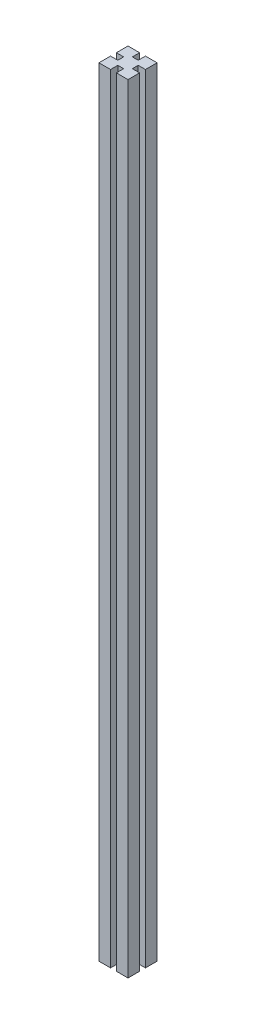
ISO-10303-21;
HEADER;
FILE_DESCRIPTION(('STEP AP214'),'2;1');
FILE_NAME('part.step','',(''),(''),'','','');
FILE_SCHEMA(('AUTOMOTIVE_DESIGN { 1 0 10303 214 1 1 1 1 }'));
ENDSEC;
DATA;
#1=APPLICATION_CONTEXT('core data for automotive mechanical design processes');
#2=APPLICATION_PROTOCOL_DEFINITION('international standard','automotive_design',2000,#1);
#3=PRODUCT_CONTEXT('',#1,'mechanical');
#4=PRODUCT('Part','Part','',(#3));
#5=PRODUCT_RELATED_PRODUCT_CATEGORY('part','',(#4));
#6=PRODUCT_DEFINITION_FORMATION('','',#4);
#7=PRODUCT_DEFINITION_CONTEXT('part definition',#1,'design');
#8=PRODUCT_DEFINITION('design','',#6,#7);
#9=PRODUCT_DEFINITION_SHAPE('','',#8);
#10=(LENGTH_UNIT() NAMED_UNIT(*) SI_UNIT(.MILLI.,.METRE.));
#11=(NAMED_UNIT(*) PLANE_ANGLE_UNIT() SI_UNIT($,.RADIAN.));
#12=(NAMED_UNIT(*) SI_UNIT($,.STERADIAN.) SOLID_ANGLE_UNIT());
#13=UNCERTAINTY_MEASURE_WITH_UNIT(LENGTH_MEASURE(1.E-05),#10,'distance_accuracy_value','');
#14=(GEOMETRIC_REPRESENTATION_CONTEXT(3) GLOBAL_UNCERTAINTY_ASSIGNED_CONTEXT((#13)) GLOBAL_UNIT_ASSIGNED_CONTEXT((#10,
#11,#12)) REPRESENTATION_CONTEXT('',''));
#15=CARTESIAN_POINT('',(0.,0.,0.));
#16=DIRECTION('',(0.,0.,1.));
#17=DIRECTION('',(1.,0.,0.));
#18=AXIS2_PLACEMENT_3D('',#15,#16,#17);
#19=CARTESIAN_POINT('',(5.00000000000001,1338.,25.));
#20=DIRECTION('',(0.,0.,-1.));
#21=DIRECTION('',(-1.,0.,0.));
#22=AXIS2_PLACEMENT_3D('',#19,#20,#21);
#23=PLANE('',#22);
#24=DIRECTION('',(1.,0.,0.));
#25=VECTOR('',#24,1.);
#26=CARTESIAN_POINT('',(5.00000000000001,0.,25.));
#27=LINE('',#26,#25);
#28=CARTESIAN_POINT('',(5.00000000000001,0.,25.));
#29=VERTEX_POINT('',#28);
#30=CARTESIAN_POINT('',(25.,0.,25.));
#31=VERTEX_POINT('',#30);
#32=EDGE_CURVE('E198',#29,#31,#27,.T.);
#33=ORIENTED_EDGE('',*,*,#32,.T.);
#34=DIRECTION('',(0.,-1.,0.));
#35=VECTOR('',#34,1.);
#36=CARTESIAN_POINT('',(25.,1338.,25.));
#37=LINE('',#36,#35);
#38=CARTESIAN_POINT('',(25.,1338.,25.));
#39=VERTEX_POINT('',#38);
#40=EDGE_CURVE('E11',#39,#31,#37,.T.);
#41=ORIENTED_EDGE('',*,*,#40,.F.);
#42=DIRECTION('',(1.,0.,0.));
#43=VECTOR('',#42,1.);
#44=CARTESIAN_POINT('',(5.00000000000001,1338.,25.));
#45=LINE('',#44,#43);
#46=CARTESIAN_POINT('',(5.00000000000001,1338.,25.));
#47=VERTEX_POINT('',#46);
#48=EDGE_CURVE('E253',#47,#39,#45,.T.);
#49=ORIENTED_EDGE('',*,*,#48,.F.);
#50=DIRECTION('',(0.,-1.,0.));
#51=VECTOR('',#50,1.);
#52=CARTESIAN_POINT('',(5.00000000000001,1338.,25.));
#53=LINE('',#52,#51);
#54=EDGE_CURVE('E118',#47,#29,#53,.T.);
#55=ORIENTED_EDGE('',*,*,#54,.T.);
#56=EDGE_LOOP('',(#33,#41,#49,#55));
#57=FACE_BOUND('',#56,.T.);
#58=ADVANCED_FACE('F32',(#57),#23,.F.);
#59=CARTESIAN_POINT('',(25.,1338.,5.));
#60=DIRECTION('',(-1.,0.,0.));
#61=DIRECTION('',(0.,0.,1.));
#62=AXIS2_PLACEMENT_3D('',#59,#60,#61);
#63=PLANE('',#62);
#64=DIRECTION('',(0.,0.,-1.));
#65=VECTOR('',#64,1.);
#66=CARTESIAN_POINT('',(25.,0.,5.));
#67=LINE('',#66,#65);
#68=CARTESIAN_POINT('',(25.,0.,5.));
#69=VERTEX_POINT('',#68);
#70=EDGE_CURVE('E200',#31,#69,#67,.T.);
#71=ORIENTED_EDGE('',*,*,#70,.T.);
#72=DIRECTION('',(0.,-1.,0.));
#73=VECTOR('',#72,1.);
#74=CARTESIAN_POINT('',(25.,1338.,5.));
#75=LINE('',#74,#73);
#76=CARTESIAN_POINT('',(25.,1338.,5.));
#77=VERTEX_POINT('',#76);
#78=EDGE_CURVE('E40',#77,#69,#75,.T.);
#79=ORIENTED_EDGE('',*,*,#78,.F.);
#80=DIRECTION('',(0.,0.,-1.));
#81=VECTOR('',#80,1.);
#82=CARTESIAN_POINT('',(25.,1338.,5.));
#83=LINE('',#82,#81);
#84=EDGE_CURVE('E125',#39,#77,#83,.T.);
#85=ORIENTED_EDGE('',*,*,#84,.F.);
#86=ORIENTED_EDGE('',*,*,#40,.T.);
#87=EDGE_LOOP('',(#71,#79,#85,#86));
#88=FACE_BOUND('',#87,.T.);
#89=ADVANCED_FACE('F292',(#88),#63,.F.);
#90=CARTESIAN_POINT('',(25.,1338.,5.));
#91=DIRECTION('',(0.,0.,1.));
#92=DIRECTION('',(1.,0.,0.));
#93=AXIS2_PLACEMENT_3D('',#90,#91,#92);
#94=PLANE('',#93);
#95=DIRECTION('',(-1.,0.,0.));
#96=VECTOR('',#95,1.);
#97=CARTESIAN_POINT('',(25.,0.,5.));
#98=LINE('',#97,#96);
#99=CARTESIAN_POINT('',(12.5,0.,5.));
#100=VERTEX_POINT('',#99);
#101=EDGE_CURVE('E203',#69,#100,#98,.T.);
#102=ORIENTED_EDGE('',*,*,#101,.T.);
#103=DIRECTION('',(0.,-1.,0.));
#104=VECTOR('',#103,1.);
#105=CARTESIAN_POINT('',(12.5,1338.,5.));
#106=LINE('',#105,#104);
#107=CARTESIAN_POINT('',(12.5,1338.,5.));
#108=VERTEX_POINT('',#107);
#109=EDGE_CURVE('E283',#108,#100,#106,.T.);
#110=ORIENTED_EDGE('',*,*,#109,.F.);
#111=DIRECTION('',(-1.,0.,0.));
#112=VECTOR('',#111,1.);
#113=CARTESIAN_POINT('',(25.,1338.,5.));
#114=LINE('',#113,#112);
#115=EDGE_CURVE('E290',#77,#108,#114,.T.);
#116=ORIENTED_EDGE('',*,*,#115,.F.);
#117=ORIENTED_EDGE('',*,*,#78,.T.);
#118=EDGE_LOOP('',(#102,#110,#116,#117));
#119=FACE_BOUND('',#118,.T.);
#120=ADVANCED_FACE('F286',(#119),#94,.F.);
#121=CARTESIAN_POINT('',(12.5,1338.,-5.));
#122=DIRECTION('',(-1.,0.,0.));
#123=DIRECTION('',(0.,0.,1.));
#124=AXIS2_PLACEMENT_3D('',#121,#122,#123);
#125=PLANE('',#124);
#126=DIRECTION('',(0.,0.,-1.));
#127=VECTOR('',#126,1.);
#128=CARTESIAN_POINT('',(12.5,0.,-5.));
#129=LINE('',#128,#127);
#130=CARTESIAN_POINT('',(12.5,0.,-5.));
#131=VERTEX_POINT('',#130);
#132=EDGE_CURVE('E206',#100,#131,#129,.T.);
#133=ORIENTED_EDGE('',*,*,#132,.T.);
#134=DIRECTION('',(0.,-1.,0.));
#135=VECTOR('',#134,1.);
#136=CARTESIAN_POINT('',(12.5,1338.,-5.));
#137=LINE('',#136,#135);
#138=CARTESIAN_POINT('',(12.5,1338.,-5.));
#139=VERTEX_POINT('',#138);
#140=EDGE_CURVE('E281',#139,#131,#137,.T.);
#141=ORIENTED_EDGE('',*,*,#140,.F.);
#142=DIRECTION('',(0.,0.,-1.));
#143=VECTOR('',#142,1.);
#144=CARTESIAN_POINT('',(12.5,1338.,-5.));
#145=LINE('',#144,#143);
#146=EDGE_CURVE('E304',#108,#139,#145,.T.);
#147=ORIENTED_EDGE('',*,*,#146,.F.);
#148=ORIENTED_EDGE('',*,*,#109,.T.);
#149=EDGE_LOOP('',(#133,#141,#147,#148));
#150=FACE_BOUND('',#149,.T.);
#151=ADVANCED_FACE('F301',(#150),#125,.F.);
#152=CARTESIAN_POINT('',(25.,1338.,-5.));
#153=DIRECTION('',(0.,0.,-1.));
#154=DIRECTION('',(-1.,0.,0.));
#155=AXIS2_PLACEMENT_3D('',#152,#153,#154);
#156=PLANE('',#155);
#157=DIRECTION('',(1.,0.,0.));
#158=VECTOR('',#157,1.);
#159=CARTESIAN_POINT('',(25.,0.,-5.));
#160=LINE('',#159,#158);
#161=CARTESIAN_POINT('',(25.,0.,-5.));
#162=VERTEX_POINT('',#161);
#163=EDGE_CURVE('E209',#131,#162,#160,.T.);
#164=ORIENTED_EDGE('',*,*,#163,.T.);
#165=DIRECTION('',(0.,-1.,0.));
#166=VECTOR('',#165,1.);
#167=CARTESIAN_POINT('',(25.,1338.,-5.));
#168=LINE('',#167,#166);
#169=CARTESIAN_POINT('',(25.,1338.,-5.));
#170=VERTEX_POINT('',#169);
#171=EDGE_CURVE('E279',#170,#162,#168,.T.);
#172=ORIENTED_EDGE('',*,*,#171,.F.);
#173=DIRECTION('',(1.,0.,0.));
#174=VECTOR('',#173,1.);
#175=CARTESIAN_POINT('',(25.,1338.,-5.));
#176=LINE('',#175,#174);
#177=EDGE_CURVE('E305',#139,#170,#176,.T.);
#178=ORIENTED_EDGE('',*,*,#177,.F.);
#179=ORIENTED_EDGE('',*,*,#140,.T.);
#180=EDGE_LOOP('',(#164,#172,#178,#179));
#181=FACE_BOUND('',#180,.T.);
#182=ADVANCED_FACE('F356',(#181),#156,.F.);
#183=CARTESIAN_POINT('',(25.,1338.,-25.));
#184=DIRECTION('',(-1.,0.,0.));
#185=DIRECTION('',(0.,0.,1.));
#186=AXIS2_PLACEMENT_3D('',#183,#184,#185);
#187=PLANE('',#186);
#188=DIRECTION('',(0.,0.,-1.));
#189=VECTOR('',#188,1.);
#190=CARTESIAN_POINT('',(25.,0.,-25.));
#191=LINE('',#190,#189);
#192=CARTESIAN_POINT('',(25.,0.,-25.));
#193=VERTEX_POINT('',#192);
#194=EDGE_CURVE('E212',#162,#193,#191,.T.);
#195=ORIENTED_EDGE('',*,*,#194,.T.);
#196=DIRECTION('',(0.,-1.,0.));
#197=VECTOR('',#196,1.);
#198=CARTESIAN_POINT('',(25.,1338.,-25.));
#199=LINE('',#198,#197);
#200=CARTESIAN_POINT('',(25.,1338.,-25.));
#201=VERTEX_POINT('',#200);
#202=EDGE_CURVE('E277',#201,#193,#199,.T.);
#203=ORIENTED_EDGE('',*,*,#202,.F.);
#204=DIRECTION('',(0.,0.,-1.));
#205=VECTOR('',#204,1.);
#206=CARTESIAN_POINT('',(25.,1338.,-25.));
#207=LINE('',#206,#205);
#208=EDGE_CURVE('E307',#170,#201,#207,.T.);
#209=ORIENTED_EDGE('',*,*,#208,.F.);
#210=ORIENTED_EDGE('',*,*,#171,.T.);
#211=EDGE_LOOP('',(#195,#203,#209,#210));
#212=FACE_BOUND('',#211,.T.);
#213=ADVANCED_FACE('F359',(#212),#187,.F.);
#214=CARTESIAN_POINT('',(5.00000000000001,1338.,-25.));
#215=DIRECTION('',(0.,0.,1.));
#216=DIRECTION('',(1.,0.,0.));
#217=AXIS2_PLACEMENT_3D('',#214,#215,#216);
#218=PLANE('',#217);
#219=DIRECTION('',(-1.,0.,0.));
#220=VECTOR('',#219,1.);
#221=CARTESIAN_POINT('',(5.00000000000001,0.,-25.));
#222=LINE('',#221,#220);
#223=CARTESIAN_POINT('',(5.00000000000001,0.,-25.));
#224=VERTEX_POINT('',#223);
#225=EDGE_CURVE('E215',#193,#224,#222,.T.);
#226=ORIENTED_EDGE('',*,*,#225,.T.);
#227=DIRECTION('',(0.,-1.,0.));
#228=VECTOR('',#227,1.);
#229=CARTESIAN_POINT('',(5.00000000000001,1338.,-25.));
#230=LINE('',#229,#228);
#231=CARTESIAN_POINT('',(5.00000000000001,1338.,-25.));
#232=VERTEX_POINT('',#231);
#233=EDGE_CURVE('E275',#232,#224,#230,.T.);
#234=ORIENTED_EDGE('',*,*,#233,.F.);
#235=DIRECTION('',(-1.,0.,0.));
#236=VECTOR('',#235,1.);
#237=CARTESIAN_POINT('',(5.00000000000001,1338.,-25.));
#238=LINE('',#237,#236);
#239=EDGE_CURVE('E313',#201,#232,#238,.T.);
#240=ORIENTED_EDGE('',*,*,#239,.F.);
#241=ORIENTED_EDGE('',*,*,#202,.T.);
#242=EDGE_LOOP('',(#226,#234,#240,#241));
#243=FACE_BOUND('',#242,.T.);
#244=ADVANCED_FACE('F363',(#243),#218,.F.);
#245=CARTESIAN_POINT('',(5.00000000000001,1338.,-25.));
#246=DIRECTION('',(1.,0.,0.));
#247=DIRECTION('',(0.,0.,-1.));
#248=AXIS2_PLACEMENT_3D('',#245,#246,#247);
#249=PLANE('',#248);
#250=DIRECTION('',(0.,0.,1.));
#251=VECTOR('',#250,1.);
#252=CARTESIAN_POINT('',(5.00000000000001,0.,-25.));
#253=LINE('',#252,#251);
#254=CARTESIAN_POINT('',(5.,0.,-12.5));
#255=VERTEX_POINT('',#254);
#256=EDGE_CURVE('E218',#224,#255,#253,.T.);
#257=ORIENTED_EDGE('',*,*,#256,.T.);
#258=DIRECTION('',(0.,-1.,0.));
#259=VECTOR('',#258,1.);
#260=CARTESIAN_POINT('',(5.,1338.,-12.5));
#261=LINE('',#260,#259);
#262=CARTESIAN_POINT('',(5.,1338.,-12.5));
#263=VERTEX_POINT('',#262);
#264=EDGE_CURVE('E273',#263,#255,#261,.T.);
#265=ORIENTED_EDGE('',*,*,#264,.F.);
#266=DIRECTION('',(0.,0.,1.));
#267=VECTOR('',#266,1.);
#268=CARTESIAN_POINT('',(5.00000000000001,1338.,-25.));
#269=LINE('',#268,#267);
#270=EDGE_CURVE('E315',#232,#263,#269,.T.);
#271=ORIENTED_EDGE('',*,*,#270,.F.);
#272=ORIENTED_EDGE('',*,*,#233,.T.);
#273=EDGE_LOOP('',(#257,#265,#271,#272));
#274=FACE_BOUND('',#273,.T.);
#275=ADVANCED_FACE('F367',(#274),#249,.F.);
#276=CARTESIAN_POINT('',(-5.,1338.,-12.5));
#277=DIRECTION('',(0.,0.,1.));
#278=DIRECTION('',(1.,0.,0.));
#279=AXIS2_PLACEMENT_3D('',#276,#277,#278);
#280=PLANE('',#279);
#281=DIRECTION('',(-1.,0.,0.));
#282=VECTOR('',#281,1.);
#283=CARTESIAN_POINT('',(-5.,0.,-12.5));
#284=LINE('',#283,#282);
#285=CARTESIAN_POINT('',(-5.,0.,-12.5));
#286=VERTEX_POINT('',#285);
#287=EDGE_CURVE('E221',#255,#286,#284,.T.);
#288=ORIENTED_EDGE('',*,*,#287,.T.);
#289=DIRECTION('',(0.,-1.,0.));
#290=VECTOR('',#289,1.);
#291=CARTESIAN_POINT('',(-5.,1338.,-12.5));
#292=LINE('',#291,#290);
#293=CARTESIAN_POINT('',(-5.,1338.,-12.5));
#294=VERTEX_POINT('',#293);
#295=EDGE_CURVE('E271',#294,#286,#292,.T.);
#296=ORIENTED_EDGE('',*,*,#295,.F.);
#297=DIRECTION('',(-1.,0.,0.));
#298=VECTOR('',#297,1.);
#299=CARTESIAN_POINT('',(-5.,1338.,-12.5));
#300=LINE('',#299,#298);
#301=EDGE_CURVE('E317',#263,#294,#300,.T.);
#302=ORIENTED_EDGE('',*,*,#301,.F.);
#303=ORIENTED_EDGE('',*,*,#264,.T.);
#304=EDGE_LOOP('',(#288,#296,#302,#303));
#305=FACE_BOUND('',#304,.T.);
#306=ADVANCED_FACE('F371',(#305),#280,.F.);
#307=CARTESIAN_POINT('',(-5.,1338.,-25.));
#308=DIRECTION('',(-1.,0.,0.));
#309=DIRECTION('',(0.,0.,1.));
#310=AXIS2_PLACEMENT_3D('',#307,#308,#309);
#311=PLANE('',#310);
#312=DIRECTION('',(0.,0.,-1.));
#313=VECTOR('',#312,1.);
#314=CARTESIAN_POINT('',(-5.,0.,-25.));
#315=LINE('',#314,#313);
#316=CARTESIAN_POINT('',(-5.,0.,-25.));
#317=VERTEX_POINT('',#316);
#318=EDGE_CURVE('E224',#286,#317,#315,.T.);
#319=ORIENTED_EDGE('',*,*,#318,.T.);
#320=DIRECTION('',(0.,-1.,0.));
#321=VECTOR('',#320,1.);
#322=CARTESIAN_POINT('',(-5.,1338.,-25.));
#323=LINE('',#322,#321);
#324=CARTESIAN_POINT('',(-5.,1338.,-25.));
#325=VERTEX_POINT('',#324);
#326=EDGE_CURVE('E269',#325,#317,#323,.T.);
#327=ORIENTED_EDGE('',*,*,#326,.F.);
#328=DIRECTION('',(0.,0.,-1.));
#329=VECTOR('',#328,1.);
#330=CARTESIAN_POINT('',(-5.,1338.,-25.));
#331=LINE('',#330,#329);
#332=EDGE_CURVE('E319',#294,#325,#331,.T.);
#333=ORIENTED_EDGE('',*,*,#332,.F.);
#334=ORIENTED_EDGE('',*,*,#295,.T.);
#335=EDGE_LOOP('',(#319,#327,#333,#334));
#336=FACE_BOUND('',#335,.T.);
#337=ADVANCED_FACE('F375',(#336),#311,.F.);
#338=CARTESIAN_POINT('',(-25.,1338.,-25.));
#339=DIRECTION('',(0.,0.,1.));
#340=DIRECTION('',(1.,0.,0.));
#341=AXIS2_PLACEMENT_3D('',#338,#339,#340);
#342=PLANE('',#341);
#343=DIRECTION('',(-1.,0.,0.));
#344=VECTOR('',#343,1.);
#345=CARTESIAN_POINT('',(-25.,0.,-25.));
#346=LINE('',#345,#344);
#347=CARTESIAN_POINT('',(-25.,0.,-25.));
#348=VERTEX_POINT('',#347);
#349=EDGE_CURVE('E227',#317,#348,#346,.T.);
#350=ORIENTED_EDGE('',*,*,#349,.T.);
#351=DIRECTION('',(0.,-1.,0.));
#352=VECTOR('',#351,1.);
#353=CARTESIAN_POINT('',(-25.,1338.,-25.));
#354=LINE('',#353,#352);
#355=CARTESIAN_POINT('',(-25.,1338.,-25.));
#356=VERTEX_POINT('',#355);
#357=EDGE_CURVE('E267',#356,#348,#354,.T.);
#358=ORIENTED_EDGE('',*,*,#357,.F.);
#359=DIRECTION('',(-1.,0.,0.));
#360=VECTOR('',#359,1.);
#361=CARTESIAN_POINT('',(-25.,1338.,-25.));
#362=LINE('',#361,#360);
#363=EDGE_CURVE('E321',#325,#356,#362,.T.);
#364=ORIENTED_EDGE('',*,*,#363,.F.);
#365=ORIENTED_EDGE('',*,*,#326,.T.);
#366=EDGE_LOOP('',(#350,#358,#364,#365));
#367=FACE_BOUND('',#366,.T.);
#368=ADVANCED_FACE('F379',(#367),#342,.F.);
#369=CARTESIAN_POINT('',(-25.,1338.,-25.));
#370=DIRECTION('',(1.,0.,0.));
#371=DIRECTION('',(0.,0.,-1.));
#372=AXIS2_PLACEMENT_3D('',#369,#370,#371);
#373=PLANE('',#372);
#374=DIRECTION('',(0.,0.,1.));
#375=VECTOR('',#374,1.);
#376=CARTESIAN_POINT('',(-25.,0.,-25.));
#377=LINE('',#376,#375);
#378=CARTESIAN_POINT('',(-25.,0.,-4.99999999999999));
#379=VERTEX_POINT('',#378);
#380=EDGE_CURVE('E230',#348,#379,#377,.T.);
#381=ORIENTED_EDGE('',*,*,#380,.T.);
#382=DIRECTION('',(0.,-1.,0.));
#383=VECTOR('',#382,1.);
#384=CARTESIAN_POINT('',(-25.,1338.,-4.99999999999999));
#385=LINE('',#384,#383);
#386=CARTESIAN_POINT('',(-25.,1338.,-4.99999999999999));
#387=VERTEX_POINT('',#386);
#388=EDGE_CURVE('E265',#387,#379,#385,.T.);
#389=ORIENTED_EDGE('',*,*,#388,.F.);
#390=DIRECTION('',(0.,0.,1.));
#391=VECTOR('',#390,1.);
#392=CARTESIAN_POINT('',(-25.,1338.,-25.));
#393=LINE('',#392,#391);
#394=EDGE_CURVE('E323',#356,#387,#393,.T.);
#395=ORIENTED_EDGE('',*,*,#394,.F.);
#396=ORIENTED_EDGE('',*,*,#357,.T.);
#397=EDGE_LOOP('',(#381,#389,#395,#396));
#398=FACE_BOUND('',#397,.T.);
#399=ADVANCED_FACE('F383',(#398),#373,.F.);
#400=CARTESIAN_POINT('',(-25.,1338.,-4.99999999999999));
#401=DIRECTION('',(0.,0.,-1.));
#402=DIRECTION('',(-1.,0.,0.));
#403=AXIS2_PLACEMENT_3D('',#400,#401,#402);
#404=PLANE('',#403);
#405=DIRECTION('',(1.,0.,0.));
#406=VECTOR('',#405,1.);
#407=CARTESIAN_POINT('',(-25.,0.,-4.99999999999999));
#408=LINE('',#407,#406);
#409=CARTESIAN_POINT('',(-12.5,0.,-5.));
#410=VERTEX_POINT('',#409);
#411=EDGE_CURVE('E233',#379,#410,#408,.T.);
#412=ORIENTED_EDGE('',*,*,#411,.T.);
#413=DIRECTION('',(0.,-1.,0.));
#414=VECTOR('',#413,1.);
#415=CARTESIAN_POINT('',(-12.5,1338.,-5.));
#416=LINE('',#415,#414);
#417=CARTESIAN_POINT('',(-12.5,1338.,-5.));
#418=VERTEX_POINT('',#417);
#419=EDGE_CURVE('E263',#418,#410,#416,.T.);
#420=ORIENTED_EDGE('',*,*,#419,.F.);
#421=DIRECTION('',(1.,0.,0.));
#422=VECTOR('',#421,1.);
#423=CARTESIAN_POINT('',(-25.,1338.,-4.99999999999999));
#424=LINE('',#423,#422);
#425=EDGE_CURVE('E325',#387,#418,#424,.T.);
#426=ORIENTED_EDGE('',*,*,#425,.F.);
#427=ORIENTED_EDGE('',*,*,#388,.T.);
#428=EDGE_LOOP('',(#412,#420,#426,#427));
#429=FACE_BOUND('',#428,.T.);
#430=ADVANCED_FACE('F387',(#429),#404,.F.);
#431=CARTESIAN_POINT('',(-12.5,1338.,-5.));
#432=DIRECTION('',(1.,0.,0.));
#433=DIRECTION('',(0.,0.,-1.));
#434=AXIS2_PLACEMENT_3D('',#431,#432,#433);
#435=PLANE('',#434);
#436=DIRECTION('',(0.,0.,1.));
#437=VECTOR('',#436,1.);
#438=CARTESIAN_POINT('',(-12.5,0.,-5.));
#439=LINE('',#438,#437);
#440=CARTESIAN_POINT('',(-12.5,0.,5.));
#441=VERTEX_POINT('',#440);
#442=EDGE_CURVE('E236',#410,#441,#439,.T.);
#443=ORIENTED_EDGE('',*,*,#442,.T.);
#444=DIRECTION('',(0.,-1.,0.));
#445=VECTOR('',#444,1.);
#446=CARTESIAN_POINT('',(-12.5,1338.,5.));
#447=LINE('',#446,#445);
#448=CARTESIAN_POINT('',(-12.5,1338.,5.));
#449=VERTEX_POINT('',#448);
#450=EDGE_CURVE('E261',#449,#441,#447,.T.);
#451=ORIENTED_EDGE('',*,*,#450,.F.);
#452=DIRECTION('',(0.,0.,1.));
#453=VECTOR('',#452,1.);
#454=CARTESIAN_POINT('',(-12.5,1338.,-5.));
#455=LINE('',#454,#453);
#456=EDGE_CURVE('E327',#418,#449,#455,.T.);
#457=ORIENTED_EDGE('',*,*,#456,.F.);
#458=ORIENTED_EDGE('',*,*,#419,.T.);
#459=EDGE_LOOP('',(#443,#451,#457,#458));
#460=FACE_BOUND('',#459,.T.);
#461=ADVANCED_FACE('F391',(#460),#435,.F.);
#462=CARTESIAN_POINT('',(-25.,1338.,5.00000000000001));
#463=DIRECTION('',(0.,0.,1.));
#464=DIRECTION('',(1.,0.,0.));
#465=AXIS2_PLACEMENT_3D('',#462,#463,#464);
#466=PLANE('',#465);
#467=DIRECTION('',(-1.,0.,0.));
#468=VECTOR('',#467,1.);
#469=CARTESIAN_POINT('',(-25.,0.,5.00000000000001));
#470=LINE('',#469,#468);
#471=CARTESIAN_POINT('',(-25.,0.,5.00000000000001));
#472=VERTEX_POINT('',#471);
#473=EDGE_CURVE('E239',#441,#472,#470,.T.);
#474=ORIENTED_EDGE('',*,*,#473,.T.);
#475=DIRECTION('',(0.,-1.,0.));
#476=VECTOR('',#475,1.);
#477=CARTESIAN_POINT('',(-25.,1338.,5.00000000000001));
#478=LINE('',#477,#476);
#479=CARTESIAN_POINT('',(-25.,1338.,5.00000000000001));
#480=VERTEX_POINT('',#479);
#481=EDGE_CURVE('E259',#480,#472,#478,.T.);
#482=ORIENTED_EDGE('',*,*,#481,.F.);
#483=DIRECTION('',(-1.,0.,0.));
#484=VECTOR('',#483,1.);
#485=CARTESIAN_POINT('',(-25.,1338.,5.00000000000001));
#486=LINE('',#485,#484);
#487=EDGE_CURVE('E329',#449,#480,#486,.T.);
#488=ORIENTED_EDGE('',*,*,#487,.F.);
#489=ORIENTED_EDGE('',*,*,#450,.T.);
#490=EDGE_LOOP('',(#474,#482,#488,#489));
#491=FACE_BOUND('',#490,.T.);
#492=ADVANCED_FACE('F395',(#491),#466,.F.);
#493=CARTESIAN_POINT('',(-25.,1338.,5.00000000000001));
#494=DIRECTION('',(1.,0.,0.));
#495=DIRECTION('',(0.,0.,-1.));
#496=AXIS2_PLACEMENT_3D('',#493,#494,#495);
#497=PLANE('',#496);
#498=DIRECTION('',(0.,0.,1.));
#499=VECTOR('',#498,1.);
#500=CARTESIAN_POINT('',(-25.,0.,5.00000000000001));
#501=LINE('',#500,#499);
#502=CARTESIAN_POINT('',(-25.,0.,25.));
#503=VERTEX_POINT('',#502);
#504=EDGE_CURVE('E242',#472,#503,#501,.T.);
#505=ORIENTED_EDGE('',*,*,#504,.T.);
#506=DIRECTION('',(0.,-1.,0.));
#507=VECTOR('',#506,1.);
#508=CARTESIAN_POINT('',(-25.,1338.,25.));
#509=LINE('',#508,#507);
#510=CARTESIAN_POINT('',(-25.,1338.,25.));
#511=VERTEX_POINT('',#510);
#512=EDGE_CURVE('E257',#511,#503,#509,.T.);
#513=ORIENTED_EDGE('',*,*,#512,.F.);
#514=DIRECTION('',(0.,0.,1.));
#515=VECTOR('',#514,1.);
#516=CARTESIAN_POINT('',(-25.,1338.,5.00000000000001));
#517=LINE('',#516,#515);
#518=EDGE_CURVE('E331',#480,#511,#517,.T.);
#519=ORIENTED_EDGE('',*,*,#518,.F.);
#520=ORIENTED_EDGE('',*,*,#481,.T.);
#521=EDGE_LOOP('',(#505,#513,#519,#520));
#522=FACE_BOUND('',#521,.T.);
#523=ADVANCED_FACE('F337',(#522),#497,.F.);
#524=CARTESIAN_POINT('',(-25.,1338.,25.));
#525=DIRECTION('',(0.,0.,-1.));
#526=DIRECTION('',(-1.,0.,0.));
#527=AXIS2_PLACEMENT_3D('',#524,#525,#526);
#528=PLANE('',#527);
#529=DIRECTION('',(1.,0.,0.));
#530=VECTOR('',#529,1.);
#531=CARTESIAN_POINT('',(-25.,0.,25.));
#532=LINE('',#531,#530);
#533=CARTESIAN_POINT('',(-5.,0.,25.));
#534=VERTEX_POINT('',#533);
#535=EDGE_CURVE('E245',#503,#534,#532,.T.);
#536=ORIENTED_EDGE('',*,*,#535,.T.);
#537=DIRECTION('',(0.,-1.,0.));
#538=VECTOR('',#537,1.);
#539=CARTESIAN_POINT('',(-5.,1338.,25.));
#540=LINE('',#539,#538);
#541=CARTESIAN_POINT('',(-5.,1338.,25.));
#542=VERTEX_POINT('',#541);
#543=EDGE_CURVE('E191',#542,#534,#540,.T.);
#544=ORIENTED_EDGE('',*,*,#543,.F.);
#545=DIRECTION('',(1.,0.,0.));
#546=VECTOR('',#545,1.);
#547=CARTESIAN_POINT('',(-25.,1338.,25.));
#548=LINE('',#547,#546);
#549=EDGE_CURVE('E180',#511,#542,#548,.T.);
#550=ORIENTED_EDGE('',*,*,#549,.F.);
#551=ORIENTED_EDGE('',*,*,#512,.T.);
#552=EDGE_LOOP('',(#536,#544,#550,#551));
#553=FACE_BOUND('',#552,.T.);
#554=ADVANCED_FACE('F341',(#553),#528,.F.);
#555=CARTESIAN_POINT('',(-5.,1338.,25.));
#556=DIRECTION('',(-1.,0.,0.));
#557=DIRECTION('',(0.,0.,1.));
#558=AXIS2_PLACEMENT_3D('',#555,#556,#557);
#559=PLANE('',#558);
#560=DIRECTION('',(0.,0.,-1.));
#561=VECTOR('',#560,1.);
#562=CARTESIAN_POINT('',(-5.,0.,25.));
#563=LINE('',#562,#561);
#564=CARTESIAN_POINT('',(-5.,0.,12.5));
#565=VERTEX_POINT('',#564);
#566=EDGE_CURVE('E188',#534,#565,#563,.T.);
#567=ORIENTED_EDGE('',*,*,#566,.T.);
#568=DIRECTION('',(0.,-1.,0.));
#569=VECTOR('',#568,1.);
#570=CARTESIAN_POINT('',(-5.,1338.,12.5));
#571=LINE('',#570,#569);
#572=CARTESIAN_POINT('',(-5.,1338.,12.5));
#573=VERTEX_POINT('',#572);
#574=EDGE_CURVE('E185',#573,#565,#571,.T.);
#575=ORIENTED_EDGE('',*,*,#574,.F.);
#576=DIRECTION('',(0.,0.,-1.));
#577=VECTOR('',#576,1.);
#578=CARTESIAN_POINT('',(-5.,1338.,25.));
#579=LINE('',#578,#577);
#580=EDGE_CURVE('E174',#542,#573,#579,.T.);
#581=ORIENTED_EDGE('',*,*,#580,.F.);
#582=ORIENTED_EDGE('',*,*,#543,.T.);
#583=EDGE_LOOP('',(#567,#575,#581,#582));
#584=FACE_BOUND('',#583,.T.);
#585=ADVANCED_FACE('F186',(#584),#559,.F.);
#586=CARTESIAN_POINT('',(-5.,1338.,12.5));
#587=DIRECTION('',(0.,0.,-1.));
#588=DIRECTION('',(-1.,0.,0.));
#589=AXIS2_PLACEMENT_3D('',#586,#587,#588);
#590=PLANE('',#589);
#591=DIRECTION('',(1.,0.,0.));
#592=VECTOR('',#591,1.);
#593=CARTESIAN_POINT('',(-5.,0.,12.5));
#594=LINE('',#593,#592);
#595=CARTESIAN_POINT('',(5.,0.,12.5));
#596=VERTEX_POINT('',#595);
#597=EDGE_CURVE('E249',#565,#596,#594,.T.);
#598=ORIENTED_EDGE('',*,*,#597,.T.);
#599=DIRECTION('',(0.,-1.,0.));
#600=VECTOR('',#599,1.);
#601=CARTESIAN_POINT('',(5.,1338.,12.5));
#602=LINE('',#601,#600);
#603=CARTESIAN_POINT('',(5.,1338.,12.5));
#604=VERTEX_POINT('',#603);
#605=EDGE_CURVE('E111',#604,#596,#602,.T.);
#606=ORIENTED_EDGE('',*,*,#605,.F.);
#607=DIRECTION('',(1.,0.,0.));
#608=VECTOR('',#607,1.);
#609=CARTESIAN_POINT('',(-5.,1338.,12.5));
#610=LINE('',#609,#608);
#611=EDGE_CURVE('E178',#573,#604,#610,.T.);
#612=ORIENTED_EDGE('',*,*,#611,.F.);
#613=ORIENTED_EDGE('',*,*,#574,.T.);
#614=EDGE_LOOP('',(#598,#606,#612,#613));
#615=FACE_BOUND('',#614,.T.);
#616=ADVANCED_FACE('F193',(#615),#590,.F.);
#617=CARTESIAN_POINT('',(5.00000000000001,1338.,25.));
#618=DIRECTION('',(1.,0.,0.));
#619=DIRECTION('',(0.,0.,-1.));
#620=AXIS2_PLACEMENT_3D('',#617,#618,#619);
#621=PLANE('',#620);
#622=DIRECTION('',(0.,0.,1.));
#623=VECTOR('',#622,1.);
#624=CARTESIAN_POINT('',(5.00000000000001,0.,25.));
#625=LINE('',#624,#623);
#626=EDGE_CURVE('E251',#596,#29,#625,.T.);
#627=ORIENTED_EDGE('',*,*,#626,.T.);
#628=ORIENTED_EDGE('',*,*,#54,.F.);
#629=DIRECTION('',(0.,0.,1.));
#630=VECTOR('',#629,1.);
#631=CARTESIAN_POINT('',(5.00000000000001,1338.,25.));
#632=LINE('',#631,#630);
#633=EDGE_CURVE('E48',#604,#47,#632,.T.);
#634=ORIENTED_EDGE('',*,*,#633,.F.);
#635=ORIENTED_EDGE('',*,*,#605,.T.);
#636=EDGE_LOOP('',(#627,#628,#634,#635));
#637=FACE_BOUND('',#636,.T.);
#638=ADVANCED_FACE('F343',(#637),#621,.F.);
#639=CARTESIAN_POINT('',(0.,1338.,0.));
#640=DIRECTION('',(0.,-1.,0.));
#641=DIRECTION('',(0.,0.,-1.));
#642=AXIS2_PLACEMENT_3D('',#639,#640,#641);
#643=PLANE('',#642);
#644=ORIENTED_EDGE('',*,*,#48,.T.);
#645=ORIENTED_EDGE('',*,*,#84,.T.);
#646=ORIENTED_EDGE('',*,*,#115,.T.);
#647=ORIENTED_EDGE('',*,*,#146,.T.);
#648=ORIENTED_EDGE('',*,*,#177,.T.);
#649=ORIENTED_EDGE('',*,*,#208,.T.);
#650=ORIENTED_EDGE('',*,*,#239,.T.);
#651=ORIENTED_EDGE('',*,*,#270,.T.);
#652=ORIENTED_EDGE('',*,*,#301,.T.);
#653=ORIENTED_EDGE('',*,*,#332,.T.);
#654=ORIENTED_EDGE('',*,*,#363,.T.);
#655=ORIENTED_EDGE('',*,*,#394,.T.);
#656=ORIENTED_EDGE('',*,*,#425,.T.);
#657=ORIENTED_EDGE('',*,*,#456,.T.);
#658=ORIENTED_EDGE('',*,*,#487,.T.);
#659=ORIENTED_EDGE('',*,*,#518,.T.);
#660=ORIENTED_EDGE('',*,*,#549,.T.);
#661=ORIENTED_EDGE('',*,*,#580,.T.);
#662=ORIENTED_EDGE('',*,*,#611,.T.);
#663=ORIENTED_EDGE('',*,*,#633,.T.);
#664=EDGE_LOOP('',(#644,#645,#646,#647,#648,#649,#650,#651,#652,#653,#654,#655,#656,#657,#658,
#659,#660,#661,#662,#663));
#665=FACE_BOUND('',#664,.T.);
#666=ADVANCED_FACE('F176',(#665),#643,.F.);
#667=CARTESIAN_POINT('',(0.,0.,0.));
#668=DIRECTION('',(0.,-1.,0.));
#669=DIRECTION('',(0.,0.,-1.));
#670=AXIS2_PLACEMENT_3D('',#667,#668,#669);
#671=PLANE('',#670);
#672=ORIENTED_EDGE('',*,*,#32,.F.);
#673=ORIENTED_EDGE('',*,*,#626,.F.);
#674=ORIENTED_EDGE('',*,*,#597,.F.);
#675=ORIENTED_EDGE('',*,*,#566,.F.);
#676=ORIENTED_EDGE('',*,*,#535,.F.);
#677=ORIENTED_EDGE('',*,*,#504,.F.);
#678=ORIENTED_EDGE('',*,*,#473,.F.);
#679=ORIENTED_EDGE('',*,*,#442,.F.);
#680=ORIENTED_EDGE('',*,*,#411,.F.);
#681=ORIENTED_EDGE('',*,*,#380,.F.);
#682=ORIENTED_EDGE('',*,*,#349,.F.);
#683=ORIENTED_EDGE('',*,*,#318,.F.);
#684=ORIENTED_EDGE('',*,*,#287,.F.);
#685=ORIENTED_EDGE('',*,*,#256,.F.);
#686=ORIENTED_EDGE('',*,*,#225,.F.);
#687=ORIENTED_EDGE('',*,*,#194,.F.);
#688=ORIENTED_EDGE('',*,*,#163,.F.);
#689=ORIENTED_EDGE('',*,*,#132,.F.);
#690=ORIENTED_EDGE('',*,*,#101,.F.);
#691=ORIENTED_EDGE('',*,*,#70,.F.);
#692=EDGE_LOOP('',(#672,#673,#674,#675,#676,#677,#678,#679,#680,#681,#682,#683,#684,#685,#686,
#687,#688,#689,#690,#691));
#693=FACE_BOUND('',#692,.T.);
#694=ADVANCED_FACE('F296',(#693),#671,.T.);
#695=CLOSED_SHELL('',(#58,#89,#120,#151,#182,#213,#244,#275,#306,#337,#368,#399,#430,#461,#492,
#523,#554,#585,#616,#638,#666,#694));
#696=MANIFOLD_SOLID_BREP('B2',#695);
#697=ADVANCED_BREP_SHAPE_REPRESENTATION('',(#18,#696),#14);
#698=SHAPE_DEFINITION_REPRESENTATION(#9,#697);
ENDSEC;
END-ISO-10303-21;
